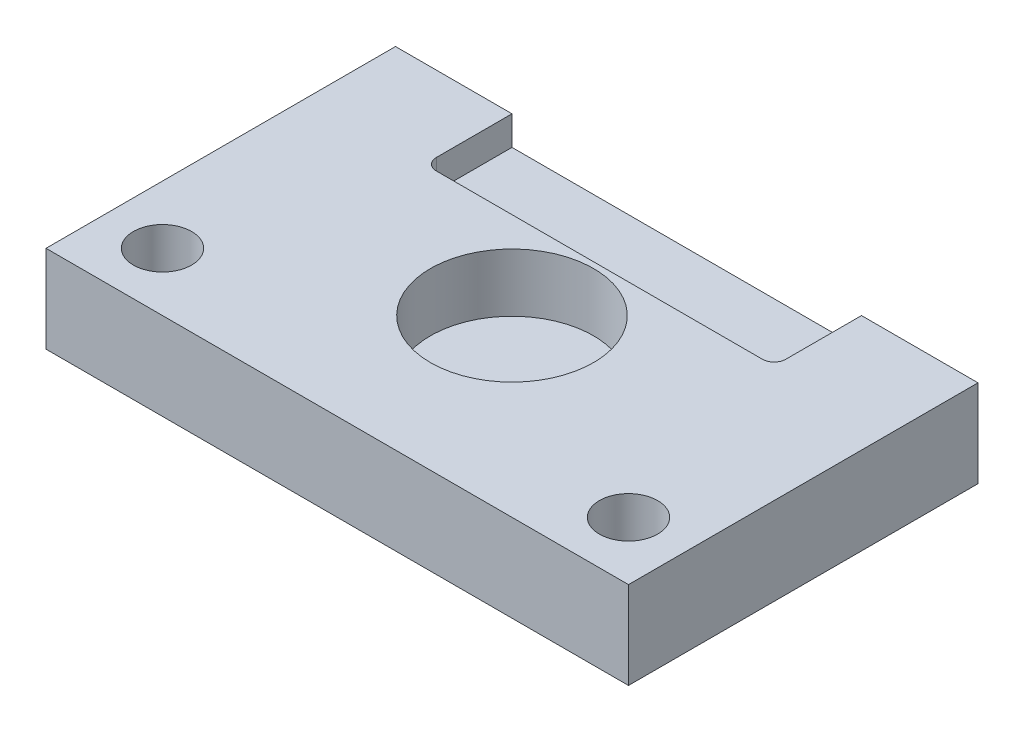
ISO-10303-21;
HEADER;
FILE_DESCRIPTION(('STEP AP214'),'2;1');
FILE_NAME('part.step','',(''),(''),'','','');
FILE_SCHEMA(('AUTOMOTIVE_DESIGN { 1 0 10303 214 1 1 1 1 }'));
ENDSEC;
DATA;
#1=APPLICATION_CONTEXT('core data for automotive mechanical design processes');
#2=APPLICATION_PROTOCOL_DEFINITION('international standard','automotive_design',2000,#1);
#3=PRODUCT_CONTEXT('',#1,'mechanical');
#4=PRODUCT('Part','Part','',(#3));
#5=PRODUCT_RELATED_PRODUCT_CATEGORY('part','',(#4));
#6=PRODUCT_DEFINITION_FORMATION('','',#4);
#7=PRODUCT_DEFINITION_CONTEXT('part definition',#1,'design');
#8=PRODUCT_DEFINITION('design','',#6,#7);
#9=PRODUCT_DEFINITION_SHAPE('','',#8);
#10=(LENGTH_UNIT() NAMED_UNIT(*) SI_UNIT(.MILLI.,.METRE.));
#11=(NAMED_UNIT(*) PLANE_ANGLE_UNIT() SI_UNIT($,.RADIAN.));
#12=(NAMED_UNIT(*) SI_UNIT($,.STERADIAN.) SOLID_ANGLE_UNIT());
#13=UNCERTAINTY_MEASURE_WITH_UNIT(LENGTH_MEASURE(1.E-05),#10,'distance_accuracy_value','');
#14=(GEOMETRIC_REPRESENTATION_CONTEXT(3) GLOBAL_UNCERTAINTY_ASSIGNED_CONTEXT((#13)) GLOBAL_UNIT_ASSIGNED_CONTEXT((#10,
#11,#12)) REPRESENTATION_CONTEXT('',''));
#15=CARTESIAN_POINT('',(0.,0.,0.));
#16=DIRECTION('',(0.,0.,1.));
#17=DIRECTION('',(1.,0.,0.));
#18=AXIS2_PLACEMENT_3D('',#15,#16,#17);
#19=CARTESIAN_POINT('',(50.,15.,30.));
#20=DIRECTION('',(-1.,0.,0.));
#21=DIRECTION('',(0.,0.,1.));
#22=AXIS2_PLACEMENT_3D('',#19,#20,#21);
#23=PLANE('',#22);
#24=DIRECTION('',(0.,0.,-1.));
#25=VECTOR('',#24,1.);
#26=CARTESIAN_POINT('',(50.,0.,30.));
#27=LINE('',#26,#25);
#28=CARTESIAN_POINT('',(50.,0.,30.));
#29=VERTEX_POINT('',#28);
#30=CARTESIAN_POINT('',(50.,0.,-30.));
#31=VERTEX_POINT('',#30);
#32=EDGE_CURVE('E183',#29,#31,#27,.T.);
#33=ORIENTED_EDGE('',*,*,#32,.T.);
#34=DIRECTION('',(0.,-1.,0.));
#35=VECTOR('',#34,1.);
#36=CARTESIAN_POINT('',(50.,15.,-30.));
#37=LINE('',#36,#35);
#38=CARTESIAN_POINT('',(50.,15.,-30.));
#39=VERTEX_POINT('',#38);
#40=EDGE_CURVE('E206',#39,#31,#37,.T.);
#41=ORIENTED_EDGE('',*,*,#40,.F.);
#42=DIRECTION('',(0.,0.,-1.));
#43=VECTOR('',#42,1.);
#44=CARTESIAN_POINT('',(50.,15.,30.));
#45=LINE('',#44,#43);
#46=CARTESIAN_POINT('',(50.,15.,30.));
#47=VERTEX_POINT('',#46);
#48=EDGE_CURVE('E167',#47,#39,#45,.T.);
#49=ORIENTED_EDGE('',*,*,#48,.F.);
#50=DIRECTION('',(0.,-1.,0.));
#51=VECTOR('',#50,1.);
#52=CARTESIAN_POINT('',(50.,15.,30.));
#53=LINE('',#52,#51);
#54=EDGE_CURVE('E182',#47,#29,#53,.T.);
#55=ORIENTED_EDGE('',*,*,#54,.T.);
#56=EDGE_LOOP('',(#33,#41,#49,#55));
#57=FACE_BOUND('',#56,.T.);
#58=ADVANCED_FACE('F46',(#57),#23,.F.);
#59=CARTESIAN_POINT('',(-50.,15.,-30.));
#60=DIRECTION('',(0.,0.,1.));
#61=DIRECTION('',(1.,0.,0.));
#62=AXIS2_PLACEMENT_3D('',#59,#60,#61);
#63=PLANE('',#62);
#64=DIRECTION('',(-1.,0.,0.));
#65=VECTOR('',#64,1.);
#66=CARTESIAN_POINT('',(-30.,10.,-30.));
#67=LINE('',#66,#65);
#68=CARTESIAN_POINT('',(30.,10.,-30.));
#69=VERTEX_POINT('',#68);
#70=CARTESIAN_POINT('',(-30.,10.,-30.));
#71=VERTEX_POINT('',#70);
#72=EDGE_CURVE('E128',#69,#71,#67,.T.);
#73=ORIENTED_EDGE('',*,*,#72,.F.);
#74=DIRECTION('',(0.,1.,0.));
#75=VECTOR('',#74,1.);
#76=CARTESIAN_POINT('',(30.,10.,-30.));
#77=LINE('',#76,#75);
#78=CARTESIAN_POINT('',(30.,15.,-30.));
#79=VERTEX_POINT('',#78);
#80=EDGE_CURVE('E135',#69,#79,#77,.T.);
#81=ORIENTED_EDGE('',*,*,#80,.T.);
#82=DIRECTION('',(-1.,0.,0.));
#83=VECTOR('',#82,1.);
#84=CARTESIAN_POINT('',(-50.,15.,-30.));
#85=LINE('',#84,#83);
#86=EDGE_CURVE('E173',#39,#79,#85,.T.);
#87=ORIENTED_EDGE('',*,*,#86,.F.);
#88=ORIENTED_EDGE('',*,*,#40,.T.);
#89=DIRECTION('',(-1.,0.,0.));
#90=VECTOR('',#89,1.);
#91=CARTESIAN_POINT('',(-50.,0.,-30.));
#92=LINE('',#91,#90);
#93=CARTESIAN_POINT('',(-50.,0.,-30.));
#94=VERTEX_POINT('',#93);
#95=EDGE_CURVE('E187',#31,#94,#92,.T.);
#96=ORIENTED_EDGE('',*,*,#95,.T.);
#97=DIRECTION('',(0.,-1.,0.));
#98=VECTOR('',#97,1.);
#99=CARTESIAN_POINT('',(-50.,15.,-30.));
#100=LINE('',#99,#98);
#101=CARTESIAN_POINT('',(-50.,15.,-30.));
#102=VERTEX_POINT('',#101);
#103=EDGE_CURVE('E202',#102,#94,#100,.T.);
#104=ORIENTED_EDGE('',*,*,#103,.F.);
#105=CARTESIAN_POINT('',(-30.,15.,-30.));
#106=VERTEX_POINT('',#105);
#107=EDGE_CURVE('E171',#106,#102,#85,.T.);
#108=ORIENTED_EDGE('',*,*,#107,.F.);
#109=DIRECTION('',(0.,1.,0.));
#110=VECTOR('',#109,1.);
#111=CARTESIAN_POINT('',(-30.,10.,-30.));
#112=LINE('',#111,#110);
#113=EDGE_CURVE('E142',#71,#106,#112,.T.);
#114=ORIENTED_EDGE('',*,*,#113,.F.);
#115=EDGE_LOOP('',(#73,#81,#87,#88,#96,#104,#108,#114));
#116=FACE_BOUND('',#115,.T.);
#117=ADVANCED_FACE('F145',(#116),#63,.F.);
#118=CARTESIAN_POINT('',(-50.,15.,30.));
#119=DIRECTION('',(1.,0.,0.));
#120=DIRECTION('',(0.,0.,-1.));
#121=AXIS2_PLACEMENT_3D('',#118,#119,#120);
#122=PLANE('',#121);
#123=DIRECTION('',(0.,0.,1.));
#124=VECTOR('',#123,1.);
#125=CARTESIAN_POINT('',(-50.,0.,30.));
#126=LINE('',#125,#124);
#127=CARTESIAN_POINT('',(-50.,0.,30.));
#128=VERTEX_POINT('',#127);
#129=EDGE_CURVE('E190',#94,#128,#126,.T.);
#130=ORIENTED_EDGE('',*,*,#129,.T.);
#131=DIRECTION('',(0.,-1.,0.));
#132=VECTOR('',#131,1.);
#133=CARTESIAN_POINT('',(-50.,15.,30.));
#134=LINE('',#133,#132);
#135=CARTESIAN_POINT('',(-50.,15.,30.));
#136=VERTEX_POINT('',#135);
#137=EDGE_CURVE('E198',#136,#128,#134,.T.);
#138=ORIENTED_EDGE('',*,*,#137,.F.);
#139=DIRECTION('',(0.,0.,1.));
#140=VECTOR('',#139,1.);
#141=CARTESIAN_POINT('',(-50.,15.,30.));
#142=LINE('',#141,#140);
#143=EDGE_CURVE('E176',#102,#136,#142,.T.);
#144=ORIENTED_EDGE('',*,*,#143,.F.);
#145=ORIENTED_EDGE('',*,*,#103,.T.);
#146=EDGE_LOOP('',(#130,#138,#144,#145));
#147=FACE_BOUND('',#146,.T.);
#148=ADVANCED_FACE('F269',(#147),#122,.F.);
#149=CARTESIAN_POINT('',(-50.,15.,30.));
#150=DIRECTION('',(0.,0.,-1.));
#151=DIRECTION('',(-1.,0.,0.));
#152=AXIS2_PLACEMENT_3D('',#149,#150,#151);
#153=PLANE('',#152);
#154=DIRECTION('',(1.,0.,0.));
#155=VECTOR('',#154,1.);
#156=CARTESIAN_POINT('',(-50.,0.,30.));
#157=LINE('',#156,#155);
#158=EDGE_CURVE('E172',#128,#29,#157,.T.);
#159=ORIENTED_EDGE('',*,*,#158,.T.);
#160=ORIENTED_EDGE('',*,*,#54,.F.);
#161=DIRECTION('',(1.,0.,0.));
#162=VECTOR('',#161,1.);
#163=CARTESIAN_POINT('',(-50.,15.,30.));
#164=LINE('',#163,#162);
#165=EDGE_CURVE('E179',#136,#47,#164,.T.);
#166=ORIENTED_EDGE('',*,*,#165,.F.);
#167=ORIENTED_EDGE('',*,*,#137,.T.);
#168=EDGE_LOOP('',(#159,#160,#166,#167));
#169=FACE_BOUND('',#168,.T.);
#170=ADVANCED_FACE('F273',(#169),#153,.F.);
#171=CARTESIAN_POINT('',(0.,15.,0.));
#172=DIRECTION('',(0.,-1.,0.));
#173=DIRECTION('',(0.,0.,-1.));
#174=AXIS2_PLACEMENT_3D('',#171,#172,#173);
#175=PLANE('',#174);
#176=CARTESIAN_POINT('',(-40.,15.,20.));
#177=DIRECTION('',(0.,1.,0.));
#178=DIRECTION('',(0.,0.,1.));
#179=AXIS2_PLACEMENT_3D('',#176,#177,#178);
#180=CIRCLE('',#179,5.);
#181=CARTESIAN_POINT('',(-40.,15.,25.));
#182=VERTEX_POINT('',#181);
#183=EDGE_CURVE('E286',#182,#182,#180,.T.);
#184=ORIENTED_EDGE('',*,*,#183,.F.);
#185=EDGE_LOOP('',(#184));
#186=FACE_BOUND('',#185,.T.);
#187=CARTESIAN_POINT('',(40.,15.,20.));
#188=DIRECTION('',(0.,1.,0.));
#189=DIRECTION('',(0.,0.,-1.));
#190=AXIS2_PLACEMENT_3D('',#187,#188,#189);
#191=CIRCLE('',#190,5.);
#192=CARTESIAN_POINT('',(40.,15.,15.));
#193=VERTEX_POINT('',#192);
#194=EDGE_CURVE('E294',#193,#193,#191,.T.);
#195=ORIENTED_EDGE('',*,*,#194,.F.);
#196=EDGE_LOOP('',(#195));
#197=FACE_BOUND('',#196,.T.);
#198=CARTESIAN_POINT('',(0.,15.,0.));
#199=DIRECTION('',(0.,1.,0.));
#200=DIRECTION('',(0.,0.,1.));
#201=AXIS2_PLACEMENT_3D('',#198,#199,#200);
#202=CIRCLE('',#201,14.);
#203=CARTESIAN_POINT('',(0.,15.,14.));
#204=VERTEX_POINT('',#203);
#205=EDGE_CURVE('E279',#204,#204,#202,.T.);
#206=ORIENTED_EDGE('',*,*,#205,.F.);
#207=EDGE_LOOP('',(#206));
#208=FACE_BOUND('',#207,.T.);
#209=ORIENTED_EDGE('',*,*,#86,.T.);
#210=DIRECTION('',(0.,0.,-1.));
#211=VECTOR('',#210,1.);
#212=CARTESIAN_POINT('',(30.,15.,-15.));
#213=LINE('',#212,#211);
#214=CARTESIAN_POINT('',(30.,15.,-17.));
#215=VERTEX_POINT('',#214);
#216=EDGE_CURVE('E138',#215,#79,#213,.T.);
#217=ORIENTED_EDGE('',*,*,#216,.F.);
#218=CARTESIAN_POINT('',(28.,15.,-17.));
#219=DIRECTION('',(0.,-1.,0.));
#220=DIRECTION('',(0.,0.,-1.));
#221=AXIS2_PLACEMENT_3D('',#218,#219,#220);
#222=CIRCLE('',#221,2.);
#223=CARTESIAN_POINT('',(28.,15.,-15.));
#224=VERTEX_POINT('',#223);
#225=EDGE_CURVE('E12',#215,#224,#222,.T.);
#226=ORIENTED_EDGE('',*,*,#225,.T.);
#227=DIRECTION('',(1.,0.,0.));
#228=VECTOR('',#227,1.);
#229=CARTESIAN_POINT('',(-30.,15.,-15.));
#230=LINE('',#229,#228);
#231=CARTESIAN_POINT('',(-28.,15.,-15.));
#232=VERTEX_POINT('',#231);
#233=EDGE_CURVE('E132',#232,#224,#230,.T.);
#234=ORIENTED_EDGE('',*,*,#233,.F.);
#235=CARTESIAN_POINT('',(-28.,15.,-17.));
#236=DIRECTION('',(0.,-1.,0.));
#237=DIRECTION('',(0.,0.,-1.));
#238=AXIS2_PLACEMENT_3D('',#235,#236,#237);
#239=CIRCLE('',#238,2.);
#240=CARTESIAN_POINT('',(-30.,15.,-17.));
#241=VERTEX_POINT('',#240);
#242=EDGE_CURVE('E56',#232,#241,#239,.T.);
#243=ORIENTED_EDGE('',*,*,#242,.T.);
#244=DIRECTION('',(0.,0.,1.));
#245=VECTOR('',#244,1.);
#246=CARTESIAN_POINT('',(-30.,15.,-15.));
#247=LINE('',#246,#245);
#248=EDGE_CURVE('E239',#106,#241,#247,.T.);
#249=ORIENTED_EDGE('',*,*,#248,.F.);
#250=ORIENTED_EDGE('',*,*,#107,.T.);
#251=ORIENTED_EDGE('',*,*,#143,.T.);
#252=ORIENTED_EDGE('',*,*,#165,.T.);
#253=ORIENTED_EDGE('',*,*,#48,.T.);
#254=EDGE_LOOP('',(#209,#217,#226,#234,#243,#249,#250,#251,#252,#253));
#255=FACE_BOUND('',#254,.T.);
#256=ADVANCED_FACE('F255',(#186,#197,#208,#255),#175,.F.);
#257=CARTESIAN_POINT('',(0.,0.,0.));
#258=DIRECTION('',(0.,-1.,0.));
#259=DIRECTION('',(0.,0.,-1.));
#260=AXIS2_PLACEMENT_3D('',#257,#258,#259);
#261=PLANE('',#260);
#262=CARTESIAN_POINT('',(-40.,0.,20.));
#263=DIRECTION('',(0.,1.,0.));
#264=DIRECTION('',(0.,0.,1.));
#265=AXIS2_PLACEMENT_3D('',#262,#263,#264);
#266=CIRCLE('',#265,5.);
#267=CARTESIAN_POINT('',(-40.,0.,25.));
#268=VERTEX_POINT('',#267);
#269=EDGE_CURVE('E283',#268,#268,#266,.T.);
#270=ORIENTED_EDGE('',*,*,#269,.T.);
#271=EDGE_LOOP('',(#270));
#272=FACE_BOUND('',#271,.T.);
#273=CARTESIAN_POINT('',(40.,0.,20.));
#274=DIRECTION('',(0.,1.,0.));
#275=DIRECTION('',(0.,0.,-1.));
#276=AXIS2_PLACEMENT_3D('',#273,#274,#275);
#277=CIRCLE('',#276,5.);
#278=CARTESIAN_POINT('',(40.,0.,15.));
#279=VERTEX_POINT('',#278);
#280=EDGE_CURVE('E290',#279,#279,#277,.T.);
#281=ORIENTED_EDGE('',*,*,#280,.T.);
#282=EDGE_LOOP('',(#281));
#283=FACE_BOUND('',#282,.T.);
#284=ORIENTED_EDGE('',*,*,#32,.F.);
#285=ORIENTED_EDGE('',*,*,#158,.F.);
#286=ORIENTED_EDGE('',*,*,#129,.F.);
#287=ORIENTED_EDGE('',*,*,#95,.F.);
#288=EDGE_LOOP('',(#284,#285,#286,#287));
#289=FACE_BOUND('',#288,.T.);
#290=ADVANCED_FACE('F265',(#272,#283,#289),#261,.T.);
#291=CARTESIAN_POINT('',(30.,10.,-15.));
#292=DIRECTION('',(1.,0.,0.));
#293=DIRECTION('',(0.,0.,-1.));
#294=AXIS2_PLACEMENT_3D('',#291,#292,#293);
#295=PLANE('',#294);
#296=DIRECTION('',(0.,0.,-1.));
#297=VECTOR('',#296,1.);
#298=CARTESIAN_POINT('',(30.,10.,-15.));
#299=LINE('',#298,#297);
#300=CARTESIAN_POINT('',(30.,10.,-17.));
#301=VERTEX_POINT('',#300);
#302=EDGE_CURVE('E123',#301,#69,#299,.T.);
#303=ORIENTED_EDGE('',*,*,#302,.F.);
#304=DIRECTION('',(0.,1.,0.));
#305=VECTOR('',#304,1.);
#306=CARTESIAN_POINT('',(30.,15.,-17.));
#307=LINE('',#306,#305);
#308=EDGE_CURVE('E225',#301,#215,#307,.T.);
#309=ORIENTED_EDGE('',*,*,#308,.T.);
#310=ORIENTED_EDGE('',*,*,#216,.T.);
#311=ORIENTED_EDGE('',*,*,#80,.F.);
#312=EDGE_LOOP('',(#303,#309,#310,#311));
#313=FACE_BOUND('',#312,.T.);
#314=ADVANCED_FACE('F136',(#313),#295,.F.);
#315=CARTESIAN_POINT('',(-30.,10.,-15.));
#316=DIRECTION('',(0.,0.,1.));
#317=DIRECTION('',(1.,0.,0.));
#318=AXIS2_PLACEMENT_3D('',#315,#316,#317);
#319=PLANE('',#318);
#320=DIRECTION('',(1.,0.,0.));
#321=VECTOR('',#320,1.);
#322=CARTESIAN_POINT('',(-30.,10.,-15.));
#323=LINE('',#322,#321);
#324=CARTESIAN_POINT('',(-28.,10.,-15.));
#325=VERTEX_POINT('',#324);
#326=CARTESIAN_POINT('',(28.,10.,-15.));
#327=VERTEX_POINT('',#326);
#328=EDGE_CURVE('E143',#325,#327,#323,.T.);
#329=ORIENTED_EDGE('',*,*,#328,.F.);
#330=DIRECTION('',(0.,1.,0.));
#331=VECTOR('',#330,1.);
#332=CARTESIAN_POINT('',(-28.,15.,-15.));
#333=LINE('',#332,#331);
#334=EDGE_CURVE('E213',#325,#232,#333,.T.);
#335=ORIENTED_EDGE('',*,*,#334,.T.);
#336=ORIENTED_EDGE('',*,*,#233,.T.);
#337=DIRECTION('',(0.,1.,0.));
#338=VECTOR('',#337,1.);
#339=CARTESIAN_POINT('',(28.,10.,-15.));
#340=LINE('',#339,#338);
#341=EDGE_CURVE('E210',#224,#327,#340,.F.);
#342=ORIENTED_EDGE('',*,*,#341,.T.);
#343=EDGE_LOOP('',(#329,#335,#336,#342));
#344=FACE_BOUND('',#343,.T.);
#345=ADVANCED_FACE('F340',(#344),#319,.F.);
#346=CARTESIAN_POINT('',(-30.,10.,-15.));
#347=DIRECTION('',(-1.,0.,0.));
#348=DIRECTION('',(0.,0.,1.));
#349=AXIS2_PLACEMENT_3D('',#346,#347,#348);
#350=PLANE('',#349);
#351=ORIENTED_EDGE('',*,*,#248,.T.);
#352=DIRECTION('',(0.,1.,0.));
#353=VECTOR('',#352,1.);
#354=CARTESIAN_POINT('',(-30.,10.,-17.));
#355=LINE('',#354,#353);
#356=CARTESIAN_POINT('',(-30.,10.,-17.));
#357=VERTEX_POINT('',#356);
#358=EDGE_CURVE('E218',#241,#357,#355,.F.);
#359=ORIENTED_EDGE('',*,*,#358,.T.);
#360=DIRECTION('',(0.,0.,1.));
#361=VECTOR('',#360,1.);
#362=CARTESIAN_POINT('',(-30.,10.,-15.));
#363=LINE('',#362,#361);
#364=EDGE_CURVE('E148',#71,#357,#363,.T.);
#365=ORIENTED_EDGE('',*,*,#364,.F.);
#366=ORIENTED_EDGE('',*,*,#113,.T.);
#367=EDGE_LOOP('',(#351,#359,#365,#366));
#368=FACE_BOUND('',#367,.T.);
#369=ADVANCED_FACE('F319',(#368),#350,.F.);
#370=CARTESIAN_POINT('',(0.,10.,0.));
#371=DIRECTION('',(0.,-1.,0.));
#372=DIRECTION('',(0.,0.,-1.));
#373=AXIS2_PLACEMENT_3D('',#370,#371,#372);
#374=PLANE('',#373);
#375=ORIENTED_EDGE('',*,*,#364,.T.);
#376=CARTESIAN_POINT('',(-28.,10.,-17.));
#377=DIRECTION('',(0.,-1.,0.));
#378=DIRECTION('',(0.,0.,-1.));
#379=AXIS2_PLACEMENT_3D('',#376,#377,#378);
#380=CIRCLE('',#379,2.);
#381=EDGE_CURVE('E223',#357,#325,#380,.F.);
#382=ORIENTED_EDGE('',*,*,#381,.T.);
#383=ORIENTED_EDGE('',*,*,#328,.T.);
#384=CARTESIAN_POINT('',(28.,10.,-17.));
#385=DIRECTION('',(0.,-1.,0.));
#386=DIRECTION('',(0.,0.,-1.));
#387=AXIS2_PLACEMENT_3D('',#384,#385,#386);
#388=CIRCLE('',#387,2.);
#389=EDGE_CURVE('E69',#327,#301,#388,.F.);
#390=ORIENTED_EDGE('',*,*,#389,.T.);
#391=ORIENTED_EDGE('',*,*,#302,.T.);
#392=ORIENTED_EDGE('',*,*,#72,.T.);
#393=EDGE_LOOP('',(#375,#382,#383,#390,#391,#392));
#394=FACE_BOUND('',#393,.T.);
#395=ADVANCED_FACE('F126',(#394),#374,.F.);
#396=CARTESIAN_POINT('',(0.,5.,0.));
#397=DIRECTION('',(0.,1.,0.));
#398=DIRECTION('',(0.,0.,1.));
#399=AXIS2_PLACEMENT_3D('',#396,#397,#398);
#400=CYLINDRICAL_SURFACE('',#399,14.);
#401=CARTESIAN_POINT('',(0.,5.,0.));
#402=DIRECTION('',(0.,1.,0.));
#403=DIRECTION('',(0.,0.,1.));
#404=AXIS2_PLACEMENT_3D('',#401,#402,#403);
#405=CIRCLE('',#404,14.);
#406=CARTESIAN_POINT('',(0.,5.,14.));
#407=VERTEX_POINT('',#406);
#408=EDGE_CURVE('E246',#407,#407,#405,.T.);
#409=ORIENTED_EDGE('',*,*,#408,.F.);
#410=EDGE_LOOP('',(#409));
#411=FACE_BOUND('',#410,.T.);
#412=ORIENTED_EDGE('',*,*,#205,.T.);
#413=EDGE_LOOP('',(#412));
#414=FACE_BOUND('',#413,.T.);
#415=ADVANCED_FACE('F308',(#411,#414),#400,.F.);
#416=CARTESIAN_POINT('',(0.,5.,0.));
#417=DIRECTION('',(0.,1.,0.));
#418=DIRECTION('',(0.,0.,1.));
#419=AXIS2_PLACEMENT_3D('',#416,#417,#418);
#420=PLANE('',#419);
#421=ORIENTED_EDGE('',*,*,#408,.T.);
#422=EDGE_LOOP('',(#421));
#423=FACE_BOUND('',#422,.T.);
#424=ADVANCED_FACE('F310',(#423),#420,.T.);
#425=CARTESIAN_POINT('',(40.,0.,20.));
#426=DIRECTION('',(0.,1.,0.));
#427=DIRECTION('',(0.,0.,1.));
#428=AXIS2_PLACEMENT_3D('',#425,#426,#427);
#429=CYLINDRICAL_SURFACE('',#428,5.);
#430=ORIENTED_EDGE('',*,*,#280,.F.);
#431=EDGE_LOOP('',(#430));
#432=FACE_BOUND('',#431,.T.);
#433=ORIENTED_EDGE('',*,*,#194,.T.);
#434=EDGE_LOOP('',(#433));
#435=FACE_BOUND('',#434,.T.);
#436=ADVANCED_FACE('F300',(#432,#435),#429,.F.);
#437=CARTESIAN_POINT('',(-40.,0.,20.));
#438=DIRECTION('',(0.,1.,0.));
#439=DIRECTION('',(0.,0.,1.));
#440=AXIS2_PLACEMENT_3D('',#437,#438,#439);
#441=CYLINDRICAL_SURFACE('',#440,5.);
#442=ORIENTED_EDGE('',*,*,#269,.F.);
#443=EDGE_LOOP('',(#442));
#444=FACE_BOUND('',#443,.T.);
#445=ORIENTED_EDGE('',*,*,#183,.T.);
#446=EDGE_LOOP('',(#445));
#447=FACE_BOUND('',#446,.T.);
#448=ADVANCED_FACE('F331',(#444,#447),#441,.F.);
#449=CARTESIAN_POINT('',(-28.,10.,-17.));
#450=DIRECTION('',(0.,-1.,0.));
#451=DIRECTION('',(0.,0.,-1.));
#452=AXIS2_PLACEMENT_3D('',#449,#450,#451);
#453=CYLINDRICAL_SURFACE('',#452,2.);
#454=ORIENTED_EDGE('',*,*,#381,.F.);
#455=ORIENTED_EDGE('',*,*,#358,.F.);
#456=ORIENTED_EDGE('',*,*,#242,.F.);
#457=ORIENTED_EDGE('',*,*,#334,.F.);
#458=EDGE_LOOP('',(#454,#455,#456,#457));
#459=FACE_BOUND('',#458,.T.);
#460=ADVANCED_FACE('F329',(#459),#453,.F.);
#461=CARTESIAN_POINT('',(28.,10.,-17.));
#462=DIRECTION('',(0.,-1.,0.));
#463=DIRECTION('',(0.,0.,-1.));
#464=AXIS2_PLACEMENT_3D('',#461,#462,#463);
#465=CYLINDRICAL_SURFACE('',#464,2.);
#466=ORIENTED_EDGE('',*,*,#389,.F.);
#467=ORIENTED_EDGE('',*,*,#341,.F.);
#468=ORIENTED_EDGE('',*,*,#225,.F.);
#469=ORIENTED_EDGE('',*,*,#308,.F.);
#470=EDGE_LOOP('',(#466,#467,#468,#469));
#471=FACE_BOUND('',#470,.T.);
#472=ADVANCED_FACE('F48',(#471),#465,.F.);
#473=CLOSED_SHELL('',(#58,#117,#148,#170,#256,#290,#314,#345,#369,#395,#415,#424,#436,#448,#460,#472));
#474=MANIFOLD_SOLID_BREP('B2',#473);
#475=ADVANCED_BREP_SHAPE_REPRESENTATION('',(#18,#474),#14);
#476=SHAPE_DEFINITION_REPRESENTATION(#9,#475);
ENDSEC;
END-ISO-10303-21;
